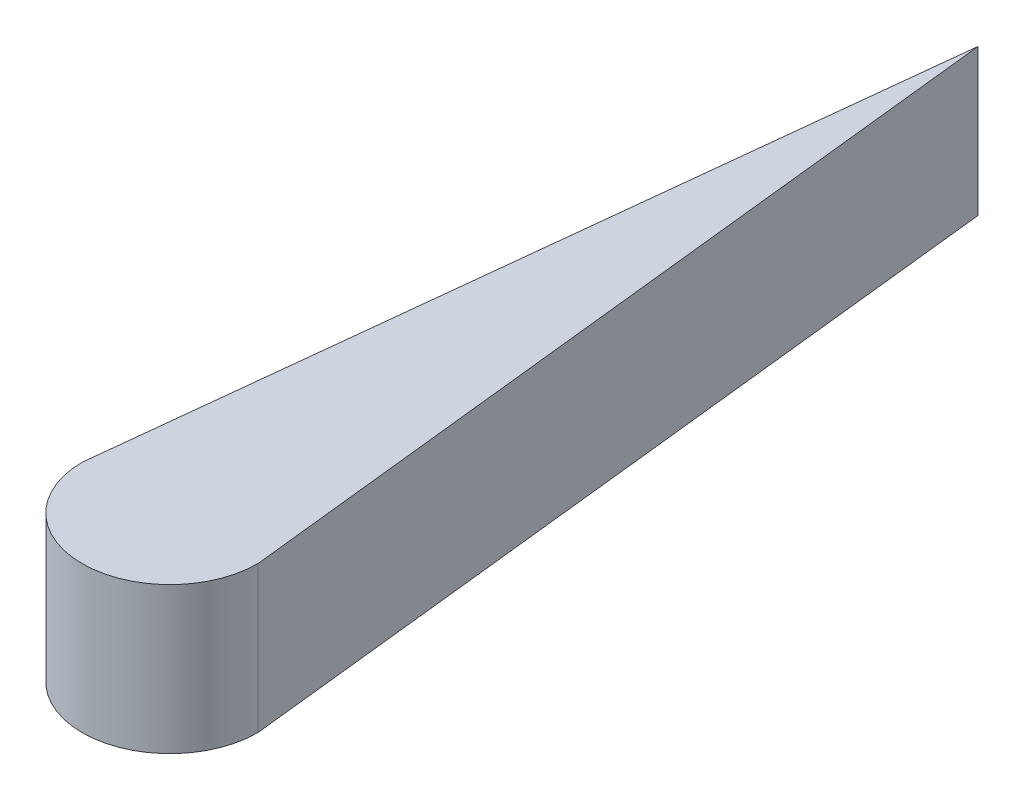
ISO-10303-21;
HEADER;
FILE_DESCRIPTION(('STEP AP214'),'2;1');
FILE_NAME('part.step','',(''),(''),'','','');
FILE_SCHEMA(('AUTOMOTIVE_DESIGN { 1 0 10303 214 1 1 1 1 }'));
ENDSEC;
DATA;
#1=APPLICATION_CONTEXT('core data for automotive mechanical design processes');
#2=APPLICATION_PROTOCOL_DEFINITION('international standard','automotive_design',2000,#1);
#3=PRODUCT_CONTEXT('',#1,'mechanical');
#4=PRODUCT('Part','Part','',(#3));
#5=PRODUCT_RELATED_PRODUCT_CATEGORY('part','',(#4));
#6=PRODUCT_DEFINITION_FORMATION('','',#4);
#7=PRODUCT_DEFINITION_CONTEXT('part definition',#1,'design');
#8=PRODUCT_DEFINITION('design','',#6,#7);
#9=PRODUCT_DEFINITION_SHAPE('','',#8);
#10=(LENGTH_UNIT() NAMED_UNIT(*) SI_UNIT(.MILLI.,.METRE.));
#11=(NAMED_UNIT(*) PLANE_ANGLE_UNIT() SI_UNIT($,.RADIAN.));
#12=(NAMED_UNIT(*) SI_UNIT($,.STERADIAN.) SOLID_ANGLE_UNIT());
#13=UNCERTAINTY_MEASURE_WITH_UNIT(LENGTH_MEASURE(1.E-05),#10,'distance_accuracy_value','');
#14=(GEOMETRIC_REPRESENTATION_CONTEXT(3) GLOBAL_UNCERTAINTY_ASSIGNED_CONTEXT((#13)) GLOBAL_UNIT_ASSIGNED_CONTEXT((#10,
#11,#12)) REPRESENTATION_CONTEXT('',''));
#15=CARTESIAN_POINT('',(0.,0.,0.));
#16=DIRECTION('',(0.,0.,1.));
#17=DIRECTION('',(1.,0.,0.));
#18=AXIS2_PLACEMENT_3D('',#15,#16,#17);
#19=CARTESIAN_POINT('',(-4.1748061653433,6.35,-0.453783278841663));
#20=DIRECTION('',(0.994144463069456,0.,0.108059180768419));
#21=DIRECTION('',(0.108059180768419,0.,-0.994144463069457));
#22=AXIS2_PLACEMENT_3D('',#19,#20,#21);
#23=PLANE('',#22);
#24=DIRECTION('',(-0.108059180768419,0.,0.994144463069457));
#25=VECTOR('',#24,1.);
#26=CARTESIAN_POINT('',(-4.1748061653433,0.,-0.453783278841663));
#27=LINE('',#26,#25);
#28=CARTESIAN_POINT('',(0.,0.,-38.862));
#29=VERTEX_POINT('',#28);
#30=CARTESIAN_POINT('',(-3.81,0.,-3.81));
#31=VERTEX_POINT('',#30);
#32=EDGE_CURVE('E79',#29,#31,#27,.T.);
#33=ORIENTED_EDGE('',*,*,#32,.T.);
#34=DIRECTION('',(0.,-1.,0.));
#35=VECTOR('',#34,1.);
#36=CARTESIAN_POINT('',(-3.81,6.35,-3.81));
#37=LINE('',#36,#35);
#38=CARTESIAN_POINT('',(-3.81,6.35,-3.81));
#39=VERTEX_POINT('',#38);
#40=EDGE_CURVE('E11',#39,#31,#37,.T.);
#41=ORIENTED_EDGE('',*,*,#40,.F.);
#42=DIRECTION('',(-0.108059180768419,0.,0.994144463069457));
#43=VECTOR('',#42,1.);
#44=CARTESIAN_POINT('',(-4.1748061653433,6.35,-0.453783278841663));
#45=LINE('',#44,#43);
#46=CARTESIAN_POINT('',(0.,6.35,-38.862));
#47=VERTEX_POINT('',#46);
#48=EDGE_CURVE('E74',#47,#39,#45,.T.);
#49=ORIENTED_EDGE('',*,*,#48,.F.);
#50=DIRECTION('',(0.,-1.,0.));
#51=VECTOR('',#50,1.);
#52=CARTESIAN_POINT('',(0.,6.35,-38.862));
#53=LINE('',#52,#51);
#54=EDGE_CURVE('E49',#47,#29,#53,.T.);
#55=ORIENTED_EDGE('',*,*,#54,.T.);
#56=EDGE_LOOP('',(#33,#41,#49,#55));
#57=FACE_BOUND('',#56,.T.);
#58=ADVANCED_FACE('F33',(#57),#23,.F.);
#59=CARTESIAN_POINT('',(0.,6.35,-3.81));
#60=DIRECTION('',(0.,-1.,0.));
#61=DIRECTION('',(0.,0.,-1.));
#62=AXIS2_PLACEMENT_3D('',#59,#60,#61);
#63=CYLINDRICAL_SURFACE('',#62,3.81);
#64=CARTESIAN_POINT('',(0.,0.,-3.81));
#65=DIRECTION('',(0.,1.,0.));
#66=DIRECTION('',(0.,0.,1.));
#67=AXIS2_PLACEMENT_3D('',#64,#65,#66);
#68=CIRCLE('',#67,3.81);
#69=CARTESIAN_POINT('',(3.81,0.,-3.81));
#70=VERTEX_POINT('',#69);
#71=EDGE_CURVE('E82',#31,#70,#68,.T.);
#72=ORIENTED_EDGE('',*,*,#71,.T.);
#73=DIRECTION('',(0.,-1.,0.));
#74=VECTOR('',#73,1.);
#75=CARTESIAN_POINT('',(3.81,6.35,-3.81));
#76=LINE('',#75,#74);
#77=CARTESIAN_POINT('',(3.81,6.35,-3.81));
#78=VERTEX_POINT('',#77);
#79=EDGE_CURVE('E41',#78,#70,#76,.T.);
#80=ORIENTED_EDGE('',*,*,#79,.F.);
#81=CARTESIAN_POINT('',(0.,6.35,-3.81));
#82=DIRECTION('',(0.,1.,0.));
#83=DIRECTION('',(0.,0.,1.));
#84=AXIS2_PLACEMENT_3D('',#81,#82,#83);
#85=CIRCLE('',#84,3.81);
#86=EDGE_CURVE('E67',#39,#78,#85,.T.);
#87=ORIENTED_EDGE('',*,*,#86,.F.);
#88=ORIENTED_EDGE('',*,*,#40,.T.);
#89=EDGE_LOOP('',(#72,#80,#87,#88));
#90=FACE_BOUND('',#89,.T.);
#91=ADVANCED_FACE('F69',(#90),#63,.T.);
#92=CARTESIAN_POINT('',(4.1748061653433,6.35,-0.453783278841663));
#93=DIRECTION('',(0.994144463069456,0.,-0.108059180768419));
#94=DIRECTION('',(-0.108059180768419,0.,-0.994144463069457));
#95=AXIS2_PLACEMENT_3D('',#92,#93,#94);
#96=PLANE('',#95);
#97=DIRECTION('',(0.108059180768419,0.,0.994144463069457));
#98=VECTOR('',#97,1.);
#99=CARTESIAN_POINT('',(4.1748061653433,0.,-0.453783278841663));
#100=LINE('',#99,#98);
#101=EDGE_CURVE('E77',#29,#70,#100,.T.);
#102=ORIENTED_EDGE('',*,*,#101,.F.);
#103=ORIENTED_EDGE('',*,*,#54,.F.);
#104=DIRECTION('',(0.108059180768419,0.,0.994144463069457));
#105=VECTOR('',#104,1.);
#106=CARTESIAN_POINT('',(4.1748061653433,6.35,-0.453783278841663));
#107=LINE('',#106,#105);
#108=EDGE_CURVE('E73',#47,#78,#107,.T.);
#109=ORIENTED_EDGE('',*,*,#108,.T.);
#110=ORIENTED_EDGE('',*,*,#79,.T.);
#111=EDGE_LOOP('',(#102,#103,#109,#110));
#112=FACE_BOUND('',#111,.T.);
#113=ADVANCED_FACE('F88',(#112),#96,.T.);
#114=CARTESIAN_POINT('',(0.,6.35,0.));
#115=DIRECTION('',(0.,1.,0.));
#116=DIRECTION('',(0.,0.,1.));
#117=AXIS2_PLACEMENT_3D('',#114,#115,#116);
#118=PLANE('',#117);
#119=ORIENTED_EDGE('',*,*,#48,.T.);
#120=ORIENTED_EDGE('',*,*,#86,.T.);
#121=ORIENTED_EDGE('',*,*,#108,.F.);
#122=EDGE_LOOP('',(#119,#120,#121));
#123=FACE_BOUND('',#122,.T.);
#124=ADVANCED_FACE('F76',(#123),#118,.T.);
#125=CARTESIAN_POINT('',(0.,0.,0.));
#126=DIRECTION('',(0.,1.,0.));
#127=DIRECTION('',(0.,0.,1.));
#128=AXIS2_PLACEMENT_3D('',#125,#126,#127);
#129=PLANE('',#128);
#130=ORIENTED_EDGE('',*,*,#32,.F.);
#131=ORIENTED_EDGE('',*,*,#101,.T.);
#132=ORIENTED_EDGE('',*,*,#71,.F.);
#133=EDGE_LOOP('',(#130,#131,#132));
#134=FACE_BOUND('',#133,.T.);
#135=ADVANCED_FACE('F95',(#134),#129,.F.);
#136=CLOSED_SHELL('',(#58,#91,#113,#124,#135));
#137=MANIFOLD_SOLID_BREP('B2',#136);
#138=ADVANCED_BREP_SHAPE_REPRESENTATION('',(#18,#137),#14);
#139=SHAPE_DEFINITION_REPRESENTATION(#9,#138);
ENDSEC;
END-ISO-10303-21;
